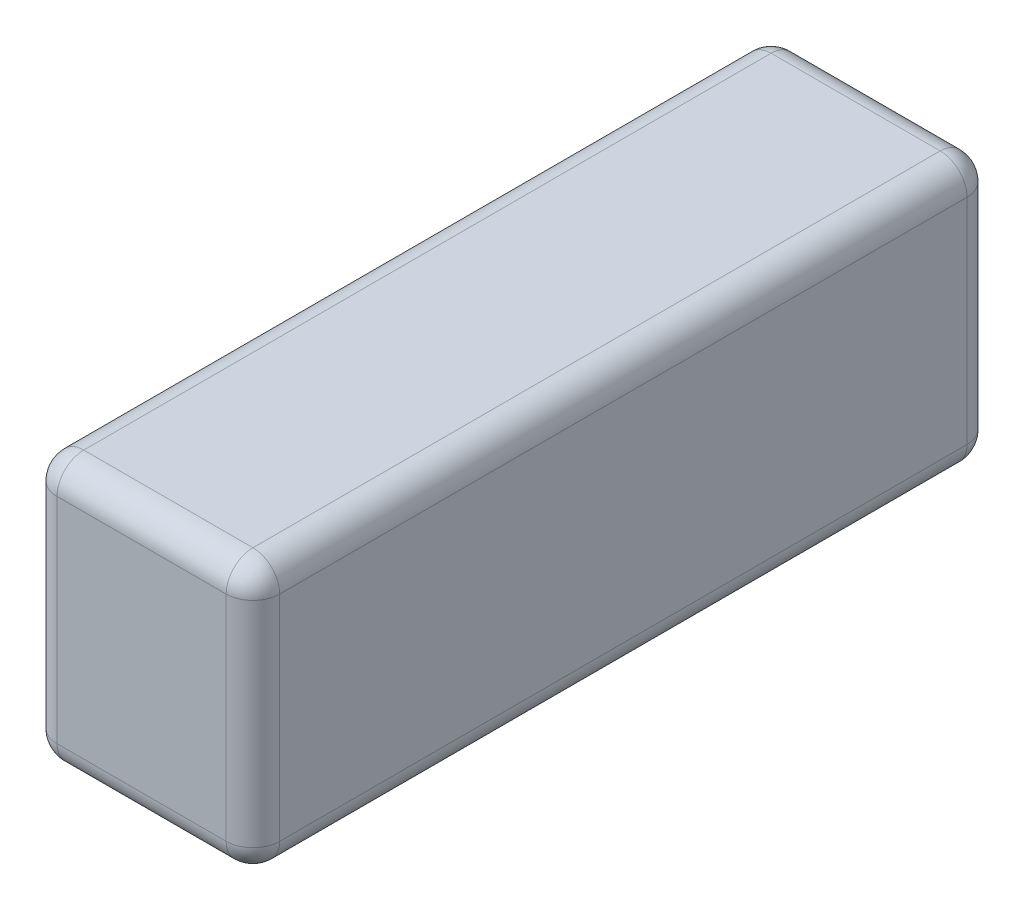
ISO-10303-21;
HEADER;
FILE_DESCRIPTION(('STEP AP214'),'2;1');
FILE_NAME('part.step','',(''),(''),'','','');
FILE_SCHEMA(('AUTOMOTIVE_DESIGN { 1 0 10303 214 1 1 1 1 }'));
ENDSEC;
DATA;
#1=APPLICATION_CONTEXT('core data for automotive mechanical design processes');
#2=APPLICATION_PROTOCOL_DEFINITION('international standard','automotive_design',2000,#1);
#3=PRODUCT_CONTEXT('',#1,'mechanical');
#4=PRODUCT('Part','Part','',(#3));
#5=PRODUCT_RELATED_PRODUCT_CATEGORY('part','',(#4));
#6=PRODUCT_DEFINITION_FORMATION('','',#4);
#7=PRODUCT_DEFINITION_CONTEXT('part definition',#1,'design');
#8=PRODUCT_DEFINITION('design','',#6,#7);
#9=PRODUCT_DEFINITION_SHAPE('','',#8);
#10=(LENGTH_UNIT() NAMED_UNIT(*) SI_UNIT(.MILLI.,.METRE.));
#11=(NAMED_UNIT(*) PLANE_ANGLE_UNIT() SI_UNIT($,.RADIAN.));
#12=(NAMED_UNIT(*) SI_UNIT($,.STERADIAN.) SOLID_ANGLE_UNIT());
#13=UNCERTAINTY_MEASURE_WITH_UNIT(LENGTH_MEASURE(1.E-05),#10,'distance_accuracy_value','');
#14=(GEOMETRIC_REPRESENTATION_CONTEXT(3) GLOBAL_UNCERTAINTY_ASSIGNED_CONTEXT((#13)) GLOBAL_UNIT_ASSIGNED_CONTEXT((#10,
#11,#12)) REPRESENTATION_CONTEXT('',''));
#15=CARTESIAN_POINT('',(0.,0.,0.));
#16=DIRECTION('',(0.,0.,1.));
#17=DIRECTION('',(1.,0.,0.));
#18=AXIS2_PLACEMENT_3D('',#15,#16,#17);
#19=CARTESIAN_POINT('',(13.208,-7.9375,21.971));
#20=DIRECTION('',(0.,0.,-1.));
#21=DIRECTION('',(-1.,0.,0.));
#22=AXIS2_PLACEMENT_3D('',#19,#20,#21);
#23=PLANE('',#22);
#24=DIRECTION('',(-1.,0.,0.));
#25=VECTOR('',#24,1.);
#26=CARTESIAN_POINT('',(13.208,6.35,21.971));
#27=LINE('',#26,#25);
#28=CARTESIAN_POINT('',(11.6205,6.35,21.971));
#29=VERTEX_POINT('',#28);
#30=CARTESIAN_POINT('',(1.5875,6.35,21.971));
#31=VERTEX_POINT('',#30);
#32=EDGE_CURVE('E237',#29,#31,#27,.T.);
#33=ORIENTED_EDGE('',*,*,#32,.T.);
#34=DIRECTION('',(0.,-1.,0.));
#35=VECTOR('',#34,1.);
#36=CARTESIAN_POINT('',(1.5875,-7.9375,21.971));
#37=LINE('',#36,#35);
#38=CARTESIAN_POINT('',(1.5875,-6.35,21.971));
#39=VERTEX_POINT('',#38);
#40=EDGE_CURVE('E240',#31,#39,#37,.T.);
#41=ORIENTED_EDGE('',*,*,#40,.T.);
#42=DIRECTION('',(-1.,0.,0.));
#43=VECTOR('',#42,1.);
#44=CARTESIAN_POINT('',(13.208,-6.35,21.971));
#45=LINE('',#44,#43);
#46=CARTESIAN_POINT('',(11.6205,-6.35,21.971));
#47=VERTEX_POINT('',#46);
#48=EDGE_CURVE('E211',#39,#47,#45,.F.);
#49=ORIENTED_EDGE('',*,*,#48,.T.);
#50=DIRECTION('',(0.,-1.,0.));
#51=VECTOR('',#50,1.);
#52=CARTESIAN_POINT('',(11.6205,-7.9375,21.971));
#53=LINE('',#52,#51);
#54=EDGE_CURVE('E234',#47,#29,#53,.F.);
#55=ORIENTED_EDGE('',*,*,#54,.T.);
#56=EDGE_LOOP('',(#33,#41,#49,#55));
#57=FACE_BOUND('',#56,.T.);
#58=ADVANCED_FACE('F32',(#57),#23,.F.);
#59=CARTESIAN_POINT('',(13.208,-7.9375,21.971));
#60=DIRECTION('',(0.,1.,0.));
#61=DIRECTION('',(0.,0.,1.));
#62=AXIS2_PLACEMENT_3D('',#59,#60,#61);
#63=PLANE('',#62);
#64=DIRECTION('',(0.,0.,-1.));
#65=VECTOR('',#64,1.);
#66=CARTESIAN_POINT('',(1.5875,-7.9375,-21.971));
#67=LINE('',#66,#65);
#68=CARTESIAN_POINT('',(1.5875,-7.9375,20.3835));
#69=VERTEX_POINT('',#68);
#70=CARTESIAN_POINT('',(1.5875,-7.9375,-20.3835));
#71=VERTEX_POINT('',#70);
#72=EDGE_CURVE('E216',#69,#71,#67,.T.);
#73=ORIENTED_EDGE('',*,*,#72,.T.);
#74=DIRECTION('',(-1.,0.,0.));
#75=VECTOR('',#74,1.);
#76=CARTESIAN_POINT('',(13.208,-7.9375,-20.3835));
#77=LINE('',#76,#75);
#78=CARTESIAN_POINT('',(11.6205,-7.9375,-20.3835));
#79=VERTEX_POINT('',#78);
#80=EDGE_CURVE('E219',#71,#79,#77,.F.);
#81=ORIENTED_EDGE('',*,*,#80,.T.);
#82=DIRECTION('',(0.,0.,-1.));
#83=VECTOR('',#82,1.);
#84=CARTESIAN_POINT('',(11.6205,-7.9375,21.971));
#85=LINE('',#84,#83);
#86=CARTESIAN_POINT('',(11.6205,-7.9375,20.3835));
#87=VERTEX_POINT('',#86);
#88=EDGE_CURVE('E217',#79,#87,#85,.F.);
#89=ORIENTED_EDGE('',*,*,#88,.T.);
#90=DIRECTION('',(-1.,0.,0.));
#91=VECTOR('',#90,1.);
#92=CARTESIAN_POINT('',(13.208,-7.9375,20.3835));
#93=LINE('',#92,#91);
#94=EDGE_CURVE('E213',#87,#69,#93,.T.);
#95=ORIENTED_EDGE('',*,*,#94,.T.);
#96=EDGE_LOOP('',(#73,#81,#89,#95));
#97=FACE_BOUND('',#96,.T.);
#98=ADVANCED_FACE('F288',(#97),#63,.F.);
#99=CARTESIAN_POINT('',(13.208,-7.9375,-21.971));
#100=DIRECTION('',(0.,0.,1.));
#101=DIRECTION('',(1.,0.,0.));
#102=AXIS2_PLACEMENT_3D('',#99,#100,#101);
#103=PLANE('',#102);
#104=DIRECTION('',(-1.,0.,0.));
#105=VECTOR('',#104,1.);
#106=CARTESIAN_POINT('',(13.208,-6.35,-21.971));
#107=LINE('',#106,#105);
#108=CARTESIAN_POINT('',(11.6205,-6.35,-21.971));
#109=VERTEX_POINT('',#108);
#110=CARTESIAN_POINT('',(1.5875,-6.35,-21.971));
#111=VERTEX_POINT('',#110);
#112=EDGE_CURVE('E130',#109,#111,#107,.T.);
#113=ORIENTED_EDGE('',*,*,#112,.T.);
#114=DIRECTION('',(0.,1.,0.));
#115=VECTOR('',#114,1.);
#116=CARTESIAN_POINT('',(1.5875,7.9375,-21.971));
#117=LINE('',#116,#115);
#118=CARTESIAN_POINT('',(1.5875,6.35,-21.971));
#119=VERTEX_POINT('',#118);
#120=EDGE_CURVE('E126',#111,#119,#117,.T.);
#121=ORIENTED_EDGE('',*,*,#120,.T.);
#122=DIRECTION('',(-1.,0.,0.));
#123=VECTOR('',#122,1.);
#124=CARTESIAN_POINT('',(13.208,6.35,-21.971));
#125=LINE('',#124,#123);
#126=CARTESIAN_POINT('',(11.6205,6.35,-21.971));
#127=VERTEX_POINT('',#126);
#128=EDGE_CURVE('E120',#119,#127,#125,.F.);
#129=ORIENTED_EDGE('',*,*,#128,.T.);
#130=DIRECTION('',(0.,1.,0.));
#131=VECTOR('',#130,1.);
#132=CARTESIAN_POINT('',(11.6205,-7.9375,-21.971));
#133=LINE('',#132,#131);
#134=EDGE_CURVE('E123',#127,#109,#133,.F.);
#135=ORIENTED_EDGE('',*,*,#134,.T.);
#136=EDGE_LOOP('',(#113,#121,#129,#135));
#137=FACE_BOUND('',#136,.T.);
#138=ADVANCED_FACE('F122',(#137),#103,.F.);
#139=CARTESIAN_POINT('',(13.208,7.9375,21.971));
#140=DIRECTION('',(0.,-1.,0.));
#141=DIRECTION('',(0.,0.,-1.));
#142=AXIS2_PLACEMENT_3D('',#139,#140,#141);
#143=PLANE('',#142);
#144=DIRECTION('',(0.,0.,1.));
#145=VECTOR('',#144,1.);
#146=CARTESIAN_POINT('',(11.6205,7.9375,21.971));
#147=LINE('',#146,#145);
#148=CARTESIAN_POINT('',(11.6205,7.9375,20.3835));
#149=VERTEX_POINT('',#148);
#150=CARTESIAN_POINT('',(11.6205,7.9375,-20.3835));
#151=VERTEX_POINT('',#150);
#152=EDGE_CURVE('E227',#149,#151,#147,.F.);
#153=ORIENTED_EDGE('',*,*,#152,.T.);
#154=DIRECTION('',(-1.,0.,0.));
#155=VECTOR('',#154,1.);
#156=CARTESIAN_POINT('',(13.208,7.9375,-20.3835));
#157=LINE('',#156,#155);
#158=CARTESIAN_POINT('',(1.5875,7.9375,-20.3835));
#159=VERTEX_POINT('',#158);
#160=EDGE_CURVE('E152',#151,#159,#157,.T.);
#161=ORIENTED_EDGE('',*,*,#160,.T.);
#162=DIRECTION('',(0.,0.,1.));
#163=VECTOR('',#162,1.);
#164=CARTESIAN_POINT('',(1.5875,7.9375,21.971));
#165=LINE('',#164,#163);
#166=CARTESIAN_POINT('',(1.5875,7.9375,20.3835));
#167=VERTEX_POINT('',#166);
#168=EDGE_CURVE('E231',#159,#167,#165,.T.);
#169=ORIENTED_EDGE('',*,*,#168,.T.);
#170=DIRECTION('',(-1.,0.,0.));
#171=VECTOR('',#170,1.);
#172=CARTESIAN_POINT('',(13.208,7.9375,20.3835));
#173=LINE('',#172,#171);
#174=EDGE_CURVE('E229',#167,#149,#173,.F.);
#175=ORIENTED_EDGE('',*,*,#174,.T.);
#176=EDGE_LOOP('',(#153,#161,#169,#175));
#177=FACE_BOUND('',#176,.T.);
#178=ADVANCED_FACE('F353',(#177),#143,.F.);
#179=CARTESIAN_POINT('',(13.208,0.,0.));
#180=DIRECTION('',(-1.,0.,0.));
#181=DIRECTION('',(0.,0.,1.));
#182=AXIS2_PLACEMENT_3D('',#179,#180,#181);
#183=PLANE('',#182);
#184=DIRECTION('',(0.,1.,0.));
#185=VECTOR('',#184,1.);
#186=CARTESIAN_POINT('',(13.208,0.,-20.3835));
#187=LINE('',#186,#185);
#188=CARTESIAN_POINT('',(13.208,-6.35,-20.3835));
#189=VERTEX_POINT('',#188);
#190=CARTESIAN_POINT('',(13.208,6.35,-20.3835));
#191=VERTEX_POINT('',#190);
#192=EDGE_CURVE('E41',#189,#191,#187,.T.);
#193=ORIENTED_EDGE('',*,*,#192,.T.);
#194=DIRECTION('',(0.,0.,1.));
#195=VECTOR('',#194,1.);
#196=CARTESIAN_POINT('',(13.208,6.35,0.));
#197=LINE('',#196,#195);
#198=CARTESIAN_POINT('',(13.208,6.35,20.3835));
#199=VERTEX_POINT('',#198);
#200=EDGE_CURVE('E11',#191,#199,#197,.T.);
#201=ORIENTED_EDGE('',*,*,#200,.T.);
#202=DIRECTION('',(0.,-1.,0.));
#203=VECTOR('',#202,1.);
#204=CARTESIAN_POINT('',(13.208,0.,20.3835));
#205=LINE('',#204,#203);
#206=CARTESIAN_POINT('',(13.208,-6.35,20.3835));
#207=VERTEX_POINT('',#206);
#208=EDGE_CURVE('E242',#199,#207,#205,.T.);
#209=ORIENTED_EDGE('',*,*,#208,.T.);
#210=DIRECTION('',(0.,0.,-1.));
#211=VECTOR('',#210,1.);
#212=CARTESIAN_POINT('',(13.208,-6.35,0.));
#213=LINE('',#212,#211);
#214=EDGE_CURVE('E52',#207,#189,#213,.T.);
#215=ORIENTED_EDGE('',*,*,#214,.T.);
#216=EDGE_LOOP('',(#193,#201,#209,#215));
#217=FACE_BOUND('',#216,.T.);
#218=ADVANCED_FACE('F356',(#217),#183,.F.);
#219=CARTESIAN_POINT('',(0.,0.,0.));
#220=DIRECTION('',(-1.,0.,0.));
#221=DIRECTION('',(0.,0.,1.));
#222=AXIS2_PLACEMENT_3D('',#219,#220,#221);
#223=PLANE('',#222);
#224=DIRECTION('',(0.,0.,1.));
#225=VECTOR('',#224,1.);
#226=CARTESIAN_POINT('',(0.,6.35,-21.971));
#227=LINE('',#226,#225);
#228=CARTESIAN_POINT('',(0.,6.35,20.3835));
#229=VERTEX_POINT('',#228);
#230=CARTESIAN_POINT('',(0.,6.35,-20.3835));
#231=VERTEX_POINT('',#230);
#232=EDGE_CURVE('E271',#229,#231,#227,.F.);
#233=ORIENTED_EDGE('',*,*,#232,.T.);
#234=DIRECTION('',(0.,1.,0.));
#235=VECTOR('',#234,1.);
#236=CARTESIAN_POINT('',(0.,-7.9375,-20.3835));
#237=LINE('',#236,#235);
#238=CARTESIAN_POINT('',(0.,-6.35,-20.3835));
#239=VERTEX_POINT('',#238);
#240=EDGE_CURVE('E221',#231,#239,#237,.F.);
#241=ORIENTED_EDGE('',*,*,#240,.T.);
#242=DIRECTION('',(0.,0.,-1.));
#243=VECTOR('',#242,1.);
#244=CARTESIAN_POINT('',(0.,-6.35,21.971));
#245=LINE('',#244,#243);
#246=CARTESIAN_POINT('',(0.,-6.35,20.3835));
#247=VERTEX_POINT('',#246);
#248=EDGE_CURVE('E266',#239,#247,#245,.F.);
#249=ORIENTED_EDGE('',*,*,#248,.T.);
#250=DIRECTION('',(0.,-1.,0.));
#251=VECTOR('',#250,1.);
#252=CARTESIAN_POINT('',(0.,7.9375,20.3835));
#253=LINE('',#252,#251);
#254=EDGE_CURVE('E281',#247,#229,#253,.F.);
#255=ORIENTED_EDGE('',*,*,#254,.T.);
#256=EDGE_LOOP('',(#233,#241,#249,#255));
#257=FACE_BOUND('',#256,.T.);
#258=ADVANCED_FACE('F274',(#257),#223,.T.);
#259=CARTESIAN_POINT('',(11.6205,0.,20.3835));
#260=DIRECTION('',(0.,-1.,0.));
#261=DIRECTION('',(0.,0.,-1.));
#262=AXIS2_PLACEMENT_3D('',#259,#260,#261);
#263=CYLINDRICAL_SURFACE('',#262,1.5875);
#264=CARTESIAN_POINT('',(11.6205,-6.35,20.3835));
#265=DIRECTION('',(0.,-1.,0.));
#266=DIRECTION('',(0.,0.,-1.));
#267=AXIS2_PLACEMENT_3D('',#264,#265,#266);
#268=CIRCLE('',#267,1.5875);
#269=EDGE_CURVE('E36',#207,#47,#268,.T.);
#270=ORIENTED_EDGE('',*,*,#269,.F.);
#271=ORIENTED_EDGE('',*,*,#208,.F.);
#272=CARTESIAN_POINT('',(11.6205,6.35,20.3835));
#273=DIRECTION('',(0.,1.,0.));
#274=DIRECTION('',(0.,0.,1.));
#275=AXIS2_PLACEMENT_3D('',#272,#273,#274);
#276=CIRCLE('',#275,1.5875);
#277=EDGE_CURVE('E191',#29,#199,#276,.T.);
#278=ORIENTED_EDGE('',*,*,#277,.F.);
#279=ORIENTED_EDGE('',*,*,#54,.F.);
#280=EDGE_LOOP('',(#270,#271,#278,#279));
#281=FACE_BOUND('',#280,.T.);
#282=ADVANCED_FACE('F34',(#281),#263,.T.);
#283=CARTESIAN_POINT('',(11.6205,-6.35,20.3835));
#284=DIRECTION('',(0.,0.,1.));
#285=DIRECTION('',(1.,0.,0.));
#286=AXIS2_PLACEMENT_3D('',#283,#284,#285);
#287=SPHERICAL_SURFACE('',#286,1.5875);
#288=CARTESIAN_POINT('',(11.6205,-6.35,20.3835));
#289=DIRECTION('',(0.,0.,1.));
#290=DIRECTION('',(1.,0.,0.));
#291=AXIS2_PLACEMENT_3D('',#288,#289,#290);
#292=CIRCLE('',#291,1.5875);
#293=EDGE_CURVE('E186',#207,#87,#292,.F.);
#294=ORIENTED_EDGE('',*,*,#293,.F.);
#295=ORIENTED_EDGE('',*,*,#269,.T.);
#296=CARTESIAN_POINT('',(11.6205,-6.35,20.3835));
#297=DIRECTION('',(1.,0.,0.));
#298=DIRECTION('',(0.,0.,-1.));
#299=AXIS2_PLACEMENT_3D('',#296,#297,#298);
#300=CIRCLE('',#299,1.5875);
#301=EDGE_CURVE('E189',#87,#47,#300,.F.);
#302=ORIENTED_EDGE('',*,*,#301,.F.);
#303=EDGE_LOOP('',(#294,#295,#302));
#304=FACE_BOUND('',#303,.T.);
#305=ADVANCED_FACE('F203',(#304),#287,.T.);
#306=CARTESIAN_POINT('',(11.6205,6.35,20.3835));
#307=DIRECTION('',(1.,0.,0.));
#308=DIRECTION('',(0.,0.,-1.));
#309=AXIS2_PLACEMENT_3D('',#306,#307,#308);
#310=SPHERICAL_SURFACE('',#309,1.5875);
#311=CARTESIAN_POINT('',(11.6205,6.35,20.3835));
#312=DIRECTION('',(1.,0.,0.));
#313=DIRECTION('',(0.,0.,-1.));
#314=AXIS2_PLACEMENT_3D('',#311,#312,#313);
#315=CIRCLE('',#314,1.5875);
#316=EDGE_CURVE('E181',#29,#149,#315,.F.);
#317=ORIENTED_EDGE('',*,*,#316,.F.);
#318=ORIENTED_EDGE('',*,*,#277,.T.);
#319=CARTESIAN_POINT('',(11.6205,6.35,20.3835));
#320=DIRECTION('',(0.,0.,1.));
#321=DIRECTION('',(1.,0.,0.));
#322=AXIS2_PLACEMENT_3D('',#319,#320,#321);
#323=CIRCLE('',#322,1.5875);
#324=EDGE_CURVE('E184',#149,#199,#323,.F.);
#325=ORIENTED_EDGE('',*,*,#324,.F.);
#326=EDGE_LOOP('',(#317,#318,#325));
#327=FACE_BOUND('',#326,.T.);
#328=ADVANCED_FACE('F348',(#327),#310,.T.);
#329=CARTESIAN_POINT('',(13.208,-6.35,20.3835));
#330=DIRECTION('',(-1.,0.,0.));
#331=DIRECTION('',(0.,0.,1.));
#332=AXIS2_PLACEMENT_3D('',#329,#330,#331);
#333=CYLINDRICAL_SURFACE('',#332,1.5875);
#334=ORIENTED_EDGE('',*,*,#301,.T.);
#335=ORIENTED_EDGE('',*,*,#48,.F.);
#336=CARTESIAN_POINT('',(1.5875,-6.35,20.3835));
#337=DIRECTION('',(-1.,0.,0.));
#338=DIRECTION('',(0.,0.,1.));
#339=AXIS2_PLACEMENT_3D('',#336,#337,#338);
#340=CIRCLE('',#339,1.5875);
#341=EDGE_CURVE('E175',#69,#39,#340,.T.);
#342=ORIENTED_EDGE('',*,*,#341,.F.);
#343=ORIENTED_EDGE('',*,*,#94,.F.);
#344=EDGE_LOOP('',(#334,#335,#342,#343));
#345=FACE_BOUND('',#344,.T.);
#346=ADVANCED_FACE('F209',(#345),#333,.T.);
#347=CARTESIAN_POINT('',(11.6205,-6.35,0.));
#348=DIRECTION('',(0.,0.,-1.));
#349=DIRECTION('',(-1.,0.,0.));
#350=AXIS2_PLACEMENT_3D('',#347,#348,#349);
#351=CYLINDRICAL_SURFACE('',#350,1.5875);
#352=ORIENTED_EDGE('',*,*,#293,.T.);
#353=ORIENTED_EDGE('',*,*,#88,.F.);
#354=CARTESIAN_POINT('',(11.6205,-6.35,-20.3835));
#355=DIRECTION('',(0.,0.,-1.));
#356=DIRECTION('',(-1.,0.,0.));
#357=AXIS2_PLACEMENT_3D('',#354,#355,#356);
#358=CIRCLE('',#357,1.5875);
#359=EDGE_CURVE('E172',#189,#79,#358,.T.);
#360=ORIENTED_EDGE('',*,*,#359,.F.);
#361=ORIENTED_EDGE('',*,*,#214,.F.);
#362=EDGE_LOOP('',(#352,#353,#360,#361));
#363=FACE_BOUND('',#362,.T.);
#364=ADVANCED_FACE('F292',(#363),#351,.T.);
#365=CARTESIAN_POINT('',(11.6205,0.,-20.3835));
#366=DIRECTION('',(0.,1.,0.));
#367=DIRECTION('',(0.,0.,1.));
#368=AXIS2_PLACEMENT_3D('',#365,#366,#367);
#369=CYLINDRICAL_SURFACE('',#368,1.5875);
#370=CARTESIAN_POINT('',(11.6205,6.35,-20.3835));
#371=DIRECTION('',(0.,1.,0.));
#372=DIRECTION('',(0.,0.,1.));
#373=AXIS2_PLACEMENT_3D('',#370,#371,#372);
#374=CIRCLE('',#373,1.5875);
#375=EDGE_CURVE('E136',#191,#127,#374,.T.);
#376=ORIENTED_EDGE('',*,*,#375,.F.);
#377=ORIENTED_EDGE('',*,*,#192,.F.);
#378=CARTESIAN_POINT('',(11.6205,-6.35,-20.3835));
#379=DIRECTION('',(0.,-1.,0.));
#380=DIRECTION('',(0.,0.,-1.));
#381=AXIS2_PLACEMENT_3D('',#378,#379,#380);
#382=CIRCLE('',#381,1.5875);
#383=EDGE_CURVE('E139',#109,#189,#382,.T.);
#384=ORIENTED_EDGE('',*,*,#383,.F.);
#385=ORIENTED_EDGE('',*,*,#134,.F.);
#386=EDGE_LOOP('',(#376,#377,#384,#385));
#387=FACE_BOUND('',#386,.T.);
#388=ADVANCED_FACE('F135',(#387),#369,.T.);
#389=CARTESIAN_POINT('',(11.6205,6.35,0.));
#390=DIRECTION('',(0.,0.,1.));
#391=DIRECTION('',(1.,0.,0.));
#392=AXIS2_PLACEMENT_3D('',#389,#390,#391);
#393=CYLINDRICAL_SURFACE('',#392,1.5875);
#394=ORIENTED_EDGE('',*,*,#324,.T.);
#395=ORIENTED_EDGE('',*,*,#200,.F.);
#396=CARTESIAN_POINT('',(11.6205,6.35,-20.3835));
#397=DIRECTION('',(0.,0.,-1.));
#398=DIRECTION('',(-1.,0.,0.));
#399=AXIS2_PLACEMENT_3D('',#396,#397,#398);
#400=CIRCLE('',#399,1.5875);
#401=EDGE_CURVE('E148',#151,#191,#400,.T.);
#402=ORIENTED_EDGE('',*,*,#401,.F.);
#403=ORIENTED_EDGE('',*,*,#152,.F.);
#404=EDGE_LOOP('',(#394,#395,#402,#403));
#405=FACE_BOUND('',#404,.T.);
#406=ADVANCED_FACE('F351',(#405),#393,.T.);
#407=CARTESIAN_POINT('',(13.208,6.35,20.3835));
#408=DIRECTION('',(-1.,0.,0.));
#409=DIRECTION('',(0.,0.,1.));
#410=AXIS2_PLACEMENT_3D('',#407,#408,#409);
#411=CYLINDRICAL_SURFACE('',#410,1.5875);
#412=ORIENTED_EDGE('',*,*,#316,.T.);
#413=ORIENTED_EDGE('',*,*,#174,.F.);
#414=CARTESIAN_POINT('',(1.5875,6.35,20.3835));
#415=DIRECTION('',(-1.,0.,0.));
#416=DIRECTION('',(0.,0.,1.));
#417=AXIS2_PLACEMENT_3D('',#414,#415,#416);
#418=CIRCLE('',#417,1.5875);
#419=EDGE_CURVE('E167',#31,#167,#418,.T.);
#420=ORIENTED_EDGE('',*,*,#419,.F.);
#421=ORIENTED_EDGE('',*,*,#32,.F.);
#422=EDGE_LOOP('',(#412,#413,#420,#421));
#423=FACE_BOUND('',#422,.T.);
#424=ADVANCED_FACE('F347',(#423),#411,.T.);
#425=CARTESIAN_POINT('',(1.5875,-7.9375,20.3835));
#426=DIRECTION('',(0.,1.,0.));
#427=DIRECTION('',(0.,0.,1.));
#428=AXIS2_PLACEMENT_3D('',#425,#426,#427);
#429=CYLINDRICAL_SURFACE('',#428,1.5875);
#430=CARTESIAN_POINT('',(1.5875,-6.35,20.3835));
#431=DIRECTION('',(0.,-1.,0.));
#432=DIRECTION('',(0.,0.,-1.));
#433=AXIS2_PLACEMENT_3D('',#430,#431,#432);
#434=CIRCLE('',#433,1.5875);
#435=EDGE_CURVE('E178',#39,#247,#434,.T.);
#436=ORIENTED_EDGE('',*,*,#435,.F.);
#437=ORIENTED_EDGE('',*,*,#40,.F.);
#438=CARTESIAN_POINT('',(1.5875,6.35,20.3835));
#439=DIRECTION('',(0.,1.,0.));
#440=DIRECTION('',(0.,0.,1.));
#441=AXIS2_PLACEMENT_3D('',#438,#439,#440);
#442=CIRCLE('',#441,1.5875);
#443=EDGE_CURVE('E165',#229,#31,#442,.T.);
#444=ORIENTED_EDGE('',*,*,#443,.F.);
#445=ORIENTED_EDGE('',*,*,#254,.F.);
#446=EDGE_LOOP('',(#436,#437,#444,#445));
#447=FACE_BOUND('',#446,.T.);
#448=ADVANCED_FACE('F304',(#447),#429,.T.);
#449=CARTESIAN_POINT('',(1.5875,-6.35,20.3835));
#450=DIRECTION('',(0.,0.,1.));
#451=DIRECTION('',(1.,0.,0.));
#452=AXIS2_PLACEMENT_3D('',#449,#450,#451);
#453=SPHERICAL_SURFACE('',#452,1.5875);
#454=ORIENTED_EDGE('',*,*,#341,.T.);
#455=ORIENTED_EDGE('',*,*,#435,.T.);
#456=CARTESIAN_POINT('',(1.5875,-6.35,20.3835));
#457=DIRECTION('',(0.,0.,1.));
#458=DIRECTION('',(1.,0.,0.));
#459=AXIS2_PLACEMENT_3D('',#456,#457,#458);
#460=CIRCLE('',#459,1.5875);
#461=EDGE_CURVE('E156',#69,#247,#460,.F.);
#462=ORIENTED_EDGE('',*,*,#461,.F.);
#463=EDGE_LOOP('',(#454,#455,#462));
#464=FACE_BOUND('',#463,.T.);
#465=ADVANCED_FACE('F296',(#464),#453,.T.);
#466=CARTESIAN_POINT('',(11.6205,-6.35,-20.3835));
#467=DIRECTION('',(1.,0.,0.));
#468=DIRECTION('',(0.,0.,-1.));
#469=AXIS2_PLACEMENT_3D('',#466,#467,#468);
#470=SPHERICAL_SURFACE('',#469,1.5875);
#471=ORIENTED_EDGE('',*,*,#383,.T.);
#472=ORIENTED_EDGE('',*,*,#359,.T.);
#473=CARTESIAN_POINT('',(11.6205,-6.35,-20.3835));
#474=DIRECTION('',(1.,0.,0.));
#475=DIRECTION('',(0.,0.,-1.));
#476=AXIS2_PLACEMENT_3D('',#473,#474,#475);
#477=CIRCLE('',#476,1.5875);
#478=EDGE_CURVE('E153',#109,#79,#477,.F.);
#479=ORIENTED_EDGE('',*,*,#478,.F.);
#480=EDGE_LOOP('',(#471,#472,#479));
#481=FACE_BOUND('',#480,.T.);
#482=ADVANCED_FACE('F294',(#481),#470,.T.);
#483=CARTESIAN_POINT('',(11.6205,6.35,-20.3835));
#484=DIRECTION('',(1.,0.,0.));
#485=DIRECTION('',(0.,0.,-1.));
#486=AXIS2_PLACEMENT_3D('',#483,#484,#485);
#487=SPHERICAL_SURFACE('',#486,1.5875);
#488=ORIENTED_EDGE('',*,*,#401,.T.);
#489=ORIENTED_EDGE('',*,*,#375,.T.);
#490=CARTESIAN_POINT('',(11.6205,6.35,-20.3835));
#491=DIRECTION('',(1.,0.,0.));
#492=DIRECTION('',(0.,0.,-1.));
#493=AXIS2_PLACEMENT_3D('',#490,#491,#492);
#494=CIRCLE('',#493,1.5875);
#495=EDGE_CURVE('E145',#151,#127,#494,.F.);
#496=ORIENTED_EDGE('',*,*,#495,.F.);
#497=EDGE_LOOP('',(#488,#489,#496));
#498=FACE_BOUND('',#497,.T.);
#499=ADVANCED_FACE('F144',(#498),#487,.T.);
#500=CARTESIAN_POINT('',(1.5875,6.35,20.3835));
#501=DIRECTION('',(0.,0.,1.));
#502=DIRECTION('',(1.,0.,0.));
#503=AXIS2_PLACEMENT_3D('',#500,#501,#502);
#504=SPHERICAL_SURFACE('',#503,1.5875);
#505=ORIENTED_EDGE('',*,*,#443,.T.);
#506=ORIENTED_EDGE('',*,*,#419,.T.);
#507=CARTESIAN_POINT('',(1.5875,6.35,20.3835));
#508=DIRECTION('',(0.,0.,1.));
#509=DIRECTION('',(1.,0.,0.));
#510=AXIS2_PLACEMENT_3D('',#507,#508,#509);
#511=CIRCLE('',#510,1.5875);
#512=EDGE_CURVE('E154',#229,#167,#511,.F.);
#513=ORIENTED_EDGE('',*,*,#512,.F.);
#514=EDGE_LOOP('',(#505,#506,#513));
#515=FACE_BOUND('',#514,.T.);
#516=ADVANCED_FACE('F302',(#515),#504,.T.);
#517=CARTESIAN_POINT('',(1.5875,-6.35,21.971));
#518=DIRECTION('',(0.,0.,1.));
#519=DIRECTION('',(1.,0.,0.));
#520=AXIS2_PLACEMENT_3D('',#517,#518,#519);
#521=CYLINDRICAL_SURFACE('',#520,1.5875);
#522=ORIENTED_EDGE('',*,*,#461,.T.);
#523=ORIENTED_EDGE('',*,*,#248,.F.);
#524=CARTESIAN_POINT('',(1.5875,-6.35,-20.3835));
#525=DIRECTION('',(0.,0.,-1.));
#526=DIRECTION('',(-1.,0.,0.));
#527=AXIS2_PLACEMENT_3D('',#524,#525,#526);
#528=CIRCLE('',#527,1.5875);
#529=EDGE_CURVE('E159',#71,#239,#528,.T.);
#530=ORIENTED_EDGE('',*,*,#529,.F.);
#531=ORIENTED_EDGE('',*,*,#72,.F.);
#532=EDGE_LOOP('',(#522,#523,#530,#531));
#533=FACE_BOUND('',#532,.T.);
#534=ADVANCED_FACE('F268',(#533),#521,.T.);
#535=CARTESIAN_POINT('',(13.208,-6.35,-20.3835));
#536=DIRECTION('',(-1.,0.,0.));
#537=DIRECTION('',(0.,0.,1.));
#538=AXIS2_PLACEMENT_3D('',#535,#536,#537);
#539=CYLINDRICAL_SURFACE('',#538,1.5875);
#540=ORIENTED_EDGE('',*,*,#478,.T.);
#541=ORIENTED_EDGE('',*,*,#80,.F.);
#542=CARTESIAN_POINT('',(1.5875,-6.35,-20.3835));
#543=DIRECTION('',(-1.,0.,0.));
#544=DIRECTION('',(0.,0.,1.));
#545=AXIS2_PLACEMENT_3D('',#542,#543,#544);
#546=CIRCLE('',#545,1.5875);
#547=EDGE_CURVE('E255',#111,#71,#546,.T.);
#548=ORIENTED_EDGE('',*,*,#547,.F.);
#549=ORIENTED_EDGE('',*,*,#112,.F.);
#550=EDGE_LOOP('',(#540,#541,#548,#549));
#551=FACE_BOUND('',#550,.T.);
#552=ADVANCED_FACE('F287',(#551),#539,.T.);
#553=CARTESIAN_POINT('',(13.208,6.35,-20.3835));
#554=DIRECTION('',(-1.,0.,0.));
#555=DIRECTION('',(0.,0.,1.));
#556=AXIS2_PLACEMENT_3D('',#553,#554,#555);
#557=CYLINDRICAL_SURFACE('',#556,1.5875);
#558=ORIENTED_EDGE('',*,*,#495,.T.);
#559=ORIENTED_EDGE('',*,*,#128,.F.);
#560=CARTESIAN_POINT('',(1.5875,6.35,-20.3835));
#561=DIRECTION('',(-1.,0.,0.));
#562=DIRECTION('',(0.,0.,1.));
#563=AXIS2_PLACEMENT_3D('',#560,#561,#562);
#564=CIRCLE('',#563,1.5875);
#565=EDGE_CURVE('E252',#159,#119,#564,.T.);
#566=ORIENTED_EDGE('',*,*,#565,.F.);
#567=ORIENTED_EDGE('',*,*,#160,.F.);
#568=EDGE_LOOP('',(#558,#559,#566,#567));
#569=FACE_BOUND('',#568,.T.);
#570=ADVANCED_FACE('F150',(#569),#557,.T.);
#571=CARTESIAN_POINT('',(1.5875,6.35,21.971));
#572=DIRECTION('',(0.,0.,-1.));
#573=DIRECTION('',(-1.,0.,0.));
#574=AXIS2_PLACEMENT_3D('',#571,#572,#573);
#575=CYLINDRICAL_SURFACE('',#574,1.5875);
#576=ORIENTED_EDGE('',*,*,#512,.T.);
#577=ORIENTED_EDGE('',*,*,#168,.F.);
#578=CARTESIAN_POINT('',(1.5875,6.35,-20.3835));
#579=DIRECTION('',(0.,0.,-1.));
#580=DIRECTION('',(-1.,0.,0.));
#581=AXIS2_PLACEMENT_3D('',#578,#579,#580);
#582=CIRCLE('',#581,1.5875);
#583=EDGE_CURVE('E250',#231,#159,#582,.T.);
#584=ORIENTED_EDGE('',*,*,#583,.F.);
#585=ORIENTED_EDGE('',*,*,#232,.F.);
#586=EDGE_LOOP('',(#576,#577,#584,#585));
#587=FACE_BOUND('',#586,.T.);
#588=ADVANCED_FACE('F325',(#587),#575,.T.);
#589=CARTESIAN_POINT('',(1.5875,-6.35,-20.3835));
#590=DIRECTION('',(0.,-1.,0.));
#591=DIRECTION('',(1.,0.,0.));
#592=AXIS2_PLACEMENT_3D('',#589,#590,#591);
#593=SPHERICAL_SURFACE('',#592,1.5875);
#594=ORIENTED_EDGE('',*,*,#547,.T.);
#595=ORIENTED_EDGE('',*,*,#529,.T.);
#596=CARTESIAN_POINT('',(1.5875,-6.35,-20.3835));
#597=DIRECTION('',(0.,-1.,0.));
#598=DIRECTION('',(0.,0.,-1.));
#599=AXIS2_PLACEMENT_3D('',#596,#597,#598);
#600=CIRCLE('',#599,1.5875);
#601=EDGE_CURVE('E248',#111,#239,#600,.F.);
#602=ORIENTED_EDGE('',*,*,#601,.F.);
#603=EDGE_LOOP('',(#594,#595,#602));
#604=FACE_BOUND('',#603,.T.);
#605=ADVANCED_FACE('F262',(#604),#593,.T.);
#606=CARTESIAN_POINT('',(1.5875,6.35,-20.3835));
#607=DIRECTION('',(0.,1.,0.));
#608=DIRECTION('',(-1.,0.,0.));
#609=AXIS2_PLACEMENT_3D('',#606,#607,#608);
#610=SPHERICAL_SURFACE('',#609,1.5875);
#611=ORIENTED_EDGE('',*,*,#583,.T.);
#612=ORIENTED_EDGE('',*,*,#565,.T.);
#613=CARTESIAN_POINT('',(1.5875,6.35,-20.3835));
#614=DIRECTION('',(0.,1.,0.));
#615=DIRECTION('',(0.,0.,1.));
#616=AXIS2_PLACEMENT_3D('',#613,#614,#615);
#617=CIRCLE('',#616,1.5875);
#618=EDGE_CURVE('E246',#231,#119,#617,.F.);
#619=ORIENTED_EDGE('',*,*,#618,.F.);
#620=EDGE_LOOP('',(#611,#612,#619));
#621=FACE_BOUND('',#620,.T.);
#622=ADVANCED_FACE('F319',(#621),#610,.T.);
#623=CARTESIAN_POINT('',(1.5875,-7.9375,-20.3835));
#624=DIRECTION('',(0.,-1.,0.));
#625=DIRECTION('',(0.,0.,-1.));
#626=AXIS2_PLACEMENT_3D('',#623,#624,#625);
#627=CYLINDRICAL_SURFACE('',#626,1.5875);
#628=ORIENTED_EDGE('',*,*,#601,.T.);
#629=ORIENTED_EDGE('',*,*,#240,.F.);
#630=ORIENTED_EDGE('',*,*,#618,.T.);
#631=ORIENTED_EDGE('',*,*,#120,.F.);
#632=EDGE_LOOP('',(#628,#629,#630,#631));
#633=FACE_BOUND('',#632,.T.);
#634=ADVANCED_FACE('F316',(#633),#627,.T.);
#635=CLOSED_SHELL('',(#58,#98,#138,#178,#218,#258,#282,#305,#328,#346,#364,#388,#406,#424,#448,
#465,#482,#499,#516,#534,#552,#570,#588,#605,#622,#634));
#636=MANIFOLD_SOLID_BREP('B2',#635);
#637=ADVANCED_BREP_SHAPE_REPRESENTATION('',(#18,#636),#14);
#638=SHAPE_DEFINITION_REPRESENTATION(#9,#637);
ENDSEC;
END-ISO-10303-21;
